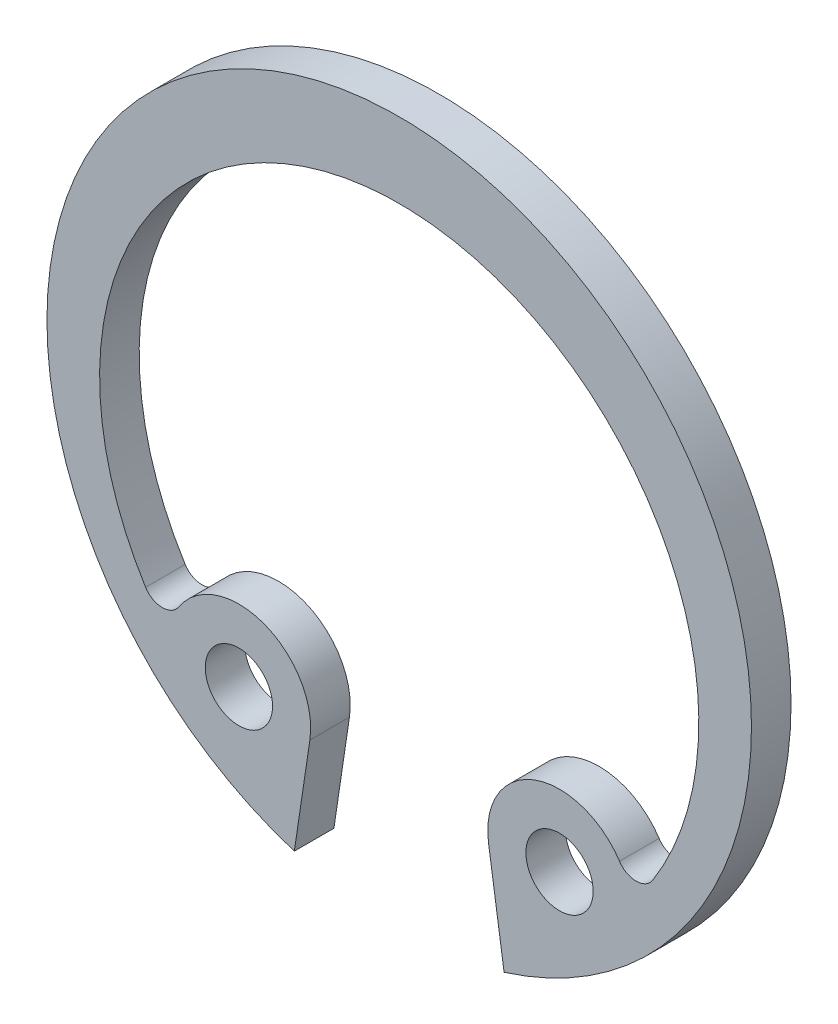
ISO-10303-21;
HEADER;
FILE_DESCRIPTION(('STEP AP214'),'2;1');
FILE_NAME('part.step','',(''),(''),'','','');
FILE_SCHEMA(('AUTOMOTIVE_DESIGN { 1 0 10303 214 1 1 1 1 }'));
ENDSEC;
DATA;
#1=APPLICATION_CONTEXT('core data for automotive mechanical design processes');
#2=APPLICATION_PROTOCOL_DEFINITION('international standard','automotive_design',2000,#1);
#3=PRODUCT_CONTEXT('',#1,'mechanical');
#4=PRODUCT('Part','Part','',(#3));
#5=PRODUCT_RELATED_PRODUCT_CATEGORY('part','',(#4));
#6=PRODUCT_DEFINITION_FORMATION('','',#4);
#7=PRODUCT_DEFINITION_CONTEXT('part definition',#1,'design');
#8=PRODUCT_DEFINITION('design','',#6,#7);
#9=PRODUCT_DEFINITION_SHAPE('','',#8);
#10=(LENGTH_UNIT() NAMED_UNIT(*) SI_UNIT(.MILLI.,.METRE.));
#11=(NAMED_UNIT(*) PLANE_ANGLE_UNIT() SI_UNIT($,.RADIAN.));
#12=(NAMED_UNIT(*) SI_UNIT($,.STERADIAN.) SOLID_ANGLE_UNIT());
#13=UNCERTAINTY_MEASURE_WITH_UNIT(LENGTH_MEASURE(1.E-05),#10,'distance_accuracy_value','');
#14=(GEOMETRIC_REPRESENTATION_CONTEXT(3) GLOBAL_UNCERTAINTY_ASSIGNED_CONTEXT((#13)) GLOBAL_UNIT_ASSIGNED_CONTEXT((#10,
#11,#12)) REPRESENTATION_CONTEXT('',''));
#15=CARTESIAN_POINT('',(0.,0.,0.));
#16=DIRECTION('',(0.,0.,1.));
#17=DIRECTION('',(1.,0.,0.));
#18=AXIS2_PLACEMENT_3D('',#15,#16,#17);
#19=CARTESIAN_POINT('',(-4.05,-5.60175763276171,1.));
#20=DIRECTION('',(0.,0.,1.));
#21=DIRECTION('',(1.,0.,0.));
#22=AXIS2_PLACEMENT_3D('',#19,#20,#21);
#23=PLANE('',#22);
#24=CARTESIAN_POINT('',(-4.05,-5.60175763276171,1.));
#25=DIRECTION('',(0.,0.,1.));
#26=DIRECTION('',(1.,0.,0.));
#27=AXIS2_PLACEMENT_3D('',#24,#25,#26);
#28=CIRCLE('',#27,0.85);
#29=CARTESIAN_POINT('',(-3.2,-5.60175763276171,1.));
#30=VERTEX_POINT('',#29);
#31=EDGE_CURVE('E161',#30,#30,#28,.T.);
#32=ORIENTED_EDGE('',*,*,#31,.F.);
#33=EDGE_LOOP('',(#32));
#34=FACE_BOUND('',#33,.T.);
#35=CARTESIAN_POINT('',(-4.05,-5.60175763276171,1.));
#36=DIRECTION('',(0.,0.,1.));
#37=DIRECTION('',(1.,0.,0.));
#38=AXIS2_PLACEMENT_3D('',#35,#36,#37);
#39=CIRCLE('',#38,1.81246617179456);
#40=CARTESIAN_POINT('',(-2.25744220428834,-5.869657190307,1.));
#41=VERTEX_POINT('',#40);
#42=CARTESIAN_POINT('',(-5.56612418959826,-4.60858037485926,1.));
#43=VERTEX_POINT('',#42);
#44=EDGE_CURVE('E179',#41,#43,#39,.T.);
#45=ORIENTED_EDGE('',*,*,#44,.T.);
#46=CARTESIAN_POINT('',(-5.98437315148016,-4.3345953280324,1.));
#47=DIRECTION('',(0.,0.,-1.));
#48=DIRECTION('',(1.,0.,0.));
#49=AXIS2_PLACEMENT_3D('',#46,#47,#48);
#50=CIRCLE('',#49,0.500000000000001);
#51=CARTESIAN_POINT('',(-6.40759614663435,-4.60083262138689,1.));
#52=VERTEX_POINT('',#51);
#53=EDGE_CURVE('E110',#43,#52,#50,.T.);
#54=ORIENTED_EDGE('',*,*,#53,.T.);
#55=CARTESIAN_POINT('',(0.,-0.57,1.));
#56=DIRECTION('',(0.,0.,-1.));
#57=DIRECTION('',(1.,0.,0.));
#58=AXIS2_PLACEMENT_3D('',#55,#56,#57);
#59=CIRCLE('',#58,7.57);
#60=CARTESIAN_POINT('',(6.40759614663435,-4.60083262138689,1.));
#61=VERTEX_POINT('',#60);
#62=EDGE_CURVE('E201',#52,#61,#59,.T.);
#63=ORIENTED_EDGE('',*,*,#62,.T.);
#64=CARTESIAN_POINT('',(5.98437315148016,-4.3345953280324,1.));
#65=DIRECTION('',(0.,0.,-1.));
#66=DIRECTION('',(-1.,0.,0.));
#67=AXIS2_PLACEMENT_3D('',#64,#65,#66);
#68=CIRCLE('',#67,0.500000000000001);
#69=CARTESIAN_POINT('',(5.56612418959826,-4.60858037485926,1.));
#70=VERTEX_POINT('',#69);
#71=EDGE_CURVE('E215',#61,#70,#68,.T.);
#72=ORIENTED_EDGE('',*,*,#71,.T.);
#73=CARTESIAN_POINT('',(4.05,-5.60175763276171,1.));
#74=DIRECTION('',(0.,0.,1.));
#75=DIRECTION('',(1.,0.,0.));
#76=AXIS2_PLACEMENT_3D('',#73,#74,#75);
#77=CIRCLE('',#76,1.81246617179456);
#78=CARTESIAN_POINT('',(2.25744220428834,-5.869657190307,1.));
#79=VERTEX_POINT('',#78);
#80=EDGE_CURVE('E133',#70,#79,#77,.T.);
#81=ORIENTED_EDGE('',*,*,#80,.T.);
#82=DIRECTION('',(0.147809411129611,-0.989015863361917,0.));
#83=VECTOR('',#82,1.);
#84=CARTESIAN_POINT('',(2.25744220428834,-5.869657190307,1.));
#85=LINE('',#84,#83);
#86=CARTESIAN_POINT('',(2.64999999999999,-8.49632273398322,1.));
#87=VERTEX_POINT('',#86);
#88=EDGE_CURVE('E127',#79,#87,#85,.T.);
#89=ORIENTED_EDGE('',*,*,#88,.T.);
#90=CARTESIAN_POINT('',(0.,0.,1.));
#91=DIRECTION('',(0.,0.,1.));
#92=DIRECTION('',(1.,0.,0.));
#93=AXIS2_PLACEMENT_3D('',#90,#91,#92);
#94=CIRCLE('',#93,8.9);
#95=CARTESIAN_POINT('',(-2.65,-8.49632273398321,1.));
#96=VERTEX_POINT('',#95);
#97=EDGE_CURVE('E131',#87,#96,#94,.T.);
#98=ORIENTED_EDGE('',*,*,#97,.T.);
#99=DIRECTION('',(0.147809411129611,0.989015863361917,0.));
#100=VECTOR('',#99,1.);
#101=CARTESIAN_POINT('',(-2.25744220428834,-5.869657190307,1.));
#102=LINE('',#101,#100);
#103=EDGE_CURVE('E58',#96,#41,#102,.T.);
#104=ORIENTED_EDGE('',*,*,#103,.T.);
#105=EDGE_LOOP('',(#45,#54,#63,#72,#81,#89,#98,#104));
#106=FACE_BOUND('',#105,.T.);
#107=CARTESIAN_POINT('',(4.05,-5.60175763276171,1.));
#108=DIRECTION('',(0.,0.,1.));
#109=DIRECTION('',(1.,0.,0.));
#110=AXIS2_PLACEMENT_3D('',#107,#108,#109);
#111=CIRCLE('',#110,0.85);
#112=CARTESIAN_POINT('',(4.9,-5.60175763276171,1.));
#113=VERTEX_POINT('',#112);
#114=EDGE_CURVE('E228',#113,#113,#111,.T.);
#115=ORIENTED_EDGE('',*,*,#114,.F.);
#116=EDGE_LOOP('',(#115));
#117=FACE_BOUND('',#116,.T.);
#118=ADVANCED_FACE('F37',(#34,#106,#117),#23,.T.);
#119=CARTESIAN_POINT('',(-4.05,-5.60175763276171,0.));
#120=DIRECTION('',(0.,0.,1.));
#121=DIRECTION('',(1.,0.,0.));
#122=AXIS2_PLACEMENT_3D('',#119,#120,#121);
#123=PLANE('',#122);
#124=CARTESIAN_POINT('',(-4.05,-5.60175763276171,0.));
#125=DIRECTION('',(0.,0.,1.));
#126=DIRECTION('',(1.,0.,0.));
#127=AXIS2_PLACEMENT_3D('',#124,#125,#126);
#128=CIRCLE('',#127,1.81246617179456);
#129=CARTESIAN_POINT('',(-2.25744220428834,-5.869657190307,0.));
#130=VERTEX_POINT('',#129);
#131=CARTESIAN_POINT('',(-5.56612418959826,-4.60858037485926,0.));
#132=VERTEX_POINT('',#131);
#133=EDGE_CURVE('E156',#130,#132,#128,.T.);
#134=ORIENTED_EDGE('',*,*,#133,.F.);
#135=DIRECTION('',(0.147809411129611,0.989015863361917,0.));
#136=VECTOR('',#135,1.);
#137=CARTESIAN_POINT('',(-2.25744220428834,-5.869657190307,0.));
#138=LINE('',#137,#136);
#139=CARTESIAN_POINT('',(-2.65,-8.49632273398321,0.));
#140=VERTEX_POINT('',#139);
#141=EDGE_CURVE('E101',#140,#130,#138,.T.);
#142=ORIENTED_EDGE('',*,*,#141,.F.);
#143=CARTESIAN_POINT('',(0.,0.,0.));
#144=DIRECTION('',(0.,0.,1.));
#145=DIRECTION('',(1.,0.,0.));
#146=AXIS2_PLACEMENT_3D('',#143,#144,#145);
#147=CIRCLE('',#146,8.9);
#148=CARTESIAN_POINT('',(2.64999999999999,-8.49632273398322,0.));
#149=VERTEX_POINT('',#148);
#150=EDGE_CURVE('E95',#149,#140,#147,.T.);
#151=ORIENTED_EDGE('',*,*,#150,.F.);
#152=DIRECTION('',(0.147809411129611,-0.989015863361917,0.));
#153=VECTOR('',#152,1.);
#154=CARTESIAN_POINT('',(2.25744220428834,-5.869657190307,0.));
#155=LINE('',#154,#153);
#156=CARTESIAN_POINT('',(2.25744220428834,-5.869657190307,0.));
#157=VERTEX_POINT('',#156);
#158=EDGE_CURVE('E142',#157,#149,#155,.T.);
#159=ORIENTED_EDGE('',*,*,#158,.F.);
#160=CARTESIAN_POINT('',(4.05,-5.60175763276171,0.));
#161=DIRECTION('',(0.,0.,1.));
#162=DIRECTION('',(1.,0.,0.));
#163=AXIS2_PLACEMENT_3D('',#160,#161,#162);
#164=CIRCLE('',#163,1.81246617179456);
#165=CARTESIAN_POINT('',(5.56612418959826,-4.60858037485926,0.));
#166=VERTEX_POINT('',#165);
#167=EDGE_CURVE('E170',#166,#157,#164,.T.);
#168=ORIENTED_EDGE('',*,*,#167,.F.);
#169=CARTESIAN_POINT('',(5.98437315148016,-4.3345953280324,0.));
#170=DIRECTION('',(0.,0.,-1.));
#171=DIRECTION('',(-1.,0.,0.));
#172=AXIS2_PLACEMENT_3D('',#169,#170,#171);
#173=CIRCLE('',#172,0.500000000000001);
#174=CARTESIAN_POINT('',(6.40759614663435,-4.60083262138689,0.));
#175=VERTEX_POINT('',#174);
#176=EDGE_CURVE('E167',#175,#166,#173,.T.);
#177=ORIENTED_EDGE('',*,*,#176,.F.);
#178=CARTESIAN_POINT('',(0.,-0.57,0.));
#179=DIRECTION('',(0.,0.,-1.));
#180=DIRECTION('',(1.,0.,0.));
#181=AXIS2_PLACEMENT_3D('',#178,#179,#180);
#182=CIRCLE('',#181,7.57);
#183=CARTESIAN_POINT('',(-6.40759614663435,-4.60083262138689,0.));
#184=VERTEX_POINT('',#183);
#185=EDGE_CURVE('E164',#184,#175,#182,.T.);
#186=ORIENTED_EDGE('',*,*,#185,.F.);
#187=CARTESIAN_POINT('',(-5.98437315148016,-4.3345953280324,0.));
#188=DIRECTION('',(0.,0.,-1.));
#189=DIRECTION('',(1.,0.,0.));
#190=AXIS2_PLACEMENT_3D('',#187,#188,#189);
#191=CIRCLE('',#190,0.500000000000001);
#192=EDGE_CURVE('E160',#132,#184,#191,.T.);
#193=ORIENTED_EDGE('',*,*,#192,.F.);
#194=EDGE_LOOP('',(#134,#142,#151,#159,#168,#177,#186,#193));
#195=FACE_BOUND('',#194,.T.);
#196=CARTESIAN_POINT('',(-4.05,-5.60175763276171,0.));
#197=DIRECTION('',(0.,0.,1.));
#198=DIRECTION('',(1.,0.,0.));
#199=AXIS2_PLACEMENT_3D('',#196,#197,#198);
#200=CIRCLE('',#199,0.85);
#201=CARTESIAN_POINT('',(-3.2,-5.60175763276171,0.));
#202=VERTEX_POINT('',#201);
#203=EDGE_CURVE('E224',#202,#202,#200,.T.);
#204=ORIENTED_EDGE('',*,*,#203,.T.);
#205=EDGE_LOOP('',(#204));
#206=FACE_BOUND('',#205,.T.);
#207=CARTESIAN_POINT('',(4.05,-5.60175763276171,0.));
#208=DIRECTION('',(0.,0.,1.));
#209=DIRECTION('',(1.,0.,0.));
#210=AXIS2_PLACEMENT_3D('',#207,#208,#209);
#211=CIRCLE('',#210,0.85);
#212=CARTESIAN_POINT('',(4.9,-5.60175763276171,0.));
#213=VERTEX_POINT('',#212);
#214=EDGE_CURVE('E232',#213,#213,#211,.T.);
#215=ORIENTED_EDGE('',*,*,#214,.T.);
#216=EDGE_LOOP('',(#215));
#217=FACE_BOUND('',#216,.T.);
#218=ADVANCED_FACE('F205',(#195,#206,#217),#123,.F.);
#219=CARTESIAN_POINT('',(-4.05,-5.60175763276171,1.));
#220=DIRECTION('',(0.,0.,-1.));
#221=DIRECTION('',(-1.,0.,0.));
#222=AXIS2_PLACEMENT_3D('',#219,#220,#221);
#223=CYLINDRICAL_SURFACE('',#222,1.81246617179456);
#224=ORIENTED_EDGE('',*,*,#133,.T.);
#225=DIRECTION('',(0.,0.,-1.));
#226=VECTOR('',#225,1.);
#227=CARTESIAN_POINT('',(-5.56612418959826,-4.60858037485926,1.));
#228=LINE('',#227,#226);
#229=EDGE_CURVE('E11',#43,#132,#228,.T.);
#230=ORIENTED_EDGE('',*,*,#229,.F.);
#231=ORIENTED_EDGE('',*,*,#44,.F.);
#232=DIRECTION('',(0.,0.,-1.));
#233=VECTOR('',#232,1.);
#234=CARTESIAN_POINT('',(-2.25744220428834,-5.869657190307,1.));
#235=LINE('',#234,#233);
#236=EDGE_CURVE('E152',#41,#130,#235,.T.);
#237=ORIENTED_EDGE('',*,*,#236,.T.);
#238=EDGE_LOOP('',(#224,#230,#231,#237));
#239=FACE_BOUND('',#238,.T.);
#240=ADVANCED_FACE('F39',(#239),#223,.T.);
#241=CARTESIAN_POINT('',(-5.98437315148016,-4.3345953280324,1.));
#242=DIRECTION('',(0.,0.,-1.));
#243=DIRECTION('',(-1.,0.,0.));
#244=AXIS2_PLACEMENT_3D('',#241,#242,#243);
#245=CYLINDRICAL_SURFACE('',#244,0.500000000000001);
#246=ORIENTED_EDGE('',*,*,#192,.T.);
#247=DIRECTION('',(0.,0.,-1.));
#248=VECTOR('',#247,1.);
#249=CARTESIAN_POINT('',(-6.40759614663435,-4.60083262138689,1.));
#250=LINE('',#249,#248);
#251=EDGE_CURVE('E47',#52,#184,#250,.T.);
#252=ORIENTED_EDGE('',*,*,#251,.F.);
#253=ORIENTED_EDGE('',*,*,#53,.F.);
#254=ORIENTED_EDGE('',*,*,#229,.T.);
#255=EDGE_LOOP('',(#246,#252,#253,#254));
#256=FACE_BOUND('',#255,.T.);
#257=ADVANCED_FACE('F265',(#256),#245,.F.);
#258=CARTESIAN_POINT('',(0.,-0.57,1.));
#259=DIRECTION('',(0.,0.,-1.));
#260=DIRECTION('',(-1.,0.,0.));
#261=AXIS2_PLACEMENT_3D('',#258,#259,#260);
#262=CYLINDRICAL_SURFACE('',#261,7.57);
#263=ORIENTED_EDGE('',*,*,#185,.T.);
#264=DIRECTION('',(0.,0.,-1.));
#265=VECTOR('',#264,1.);
#266=CARTESIAN_POINT('',(6.40759614663435,-4.60083262138689,1.));
#267=LINE('',#266,#265);
#268=EDGE_CURVE('E190',#61,#175,#267,.T.);
#269=ORIENTED_EDGE('',*,*,#268,.F.);
#270=ORIENTED_EDGE('',*,*,#62,.F.);
#271=ORIENTED_EDGE('',*,*,#251,.T.);
#272=EDGE_LOOP('',(#263,#269,#270,#271));
#273=FACE_BOUND('',#272,.T.);
#274=ADVANCED_FACE('F199',(#273),#262,.F.);
#275=CARTESIAN_POINT('',(5.98437315148016,-4.3345953280324,1.));
#276=DIRECTION('',(0.,0.,-1.));
#277=DIRECTION('',(-1.,0.,0.));
#278=AXIS2_PLACEMENT_3D('',#275,#276,#277);
#279=CYLINDRICAL_SURFACE('',#278,0.500000000000001);
#280=ORIENTED_EDGE('',*,*,#176,.T.);
#281=DIRECTION('',(0.,0.,-1.));
#282=VECTOR('',#281,1.);
#283=CARTESIAN_POINT('',(5.56612418959826,-4.60858037485926,1.));
#284=LINE('',#283,#282);
#285=EDGE_CURVE('E186',#70,#166,#284,.T.);
#286=ORIENTED_EDGE('',*,*,#285,.F.);
#287=ORIENTED_EDGE('',*,*,#71,.F.);
#288=ORIENTED_EDGE('',*,*,#268,.T.);
#289=EDGE_LOOP('',(#280,#286,#287,#288));
#290=FACE_BOUND('',#289,.T.);
#291=ADVANCED_FACE('F210',(#290),#279,.F.);
#292=CARTESIAN_POINT('',(4.05,-5.60175763276171,1.));
#293=DIRECTION('',(0.,0.,-1.));
#294=DIRECTION('',(-1.,0.,0.));
#295=AXIS2_PLACEMENT_3D('',#292,#293,#294);
#296=CYLINDRICAL_SURFACE('',#295,1.81246617179456);
#297=ORIENTED_EDGE('',*,*,#167,.T.);
#298=DIRECTION('',(0.,0.,-1.));
#299=VECTOR('',#298,1.);
#300=CARTESIAN_POINT('',(2.25744220428834,-5.869657190307,1.));
#301=LINE('',#300,#299);
#302=EDGE_CURVE('E144',#79,#157,#301,.T.);
#303=ORIENTED_EDGE('',*,*,#302,.F.);
#304=ORIENTED_EDGE('',*,*,#80,.F.);
#305=ORIENTED_EDGE('',*,*,#285,.T.);
#306=EDGE_LOOP('',(#297,#303,#304,#305));
#307=FACE_BOUND('',#306,.T.);
#308=ADVANCED_FACE('F213',(#307),#296,.T.);
#309=CARTESIAN_POINT('',(2.25744220428834,-5.869657190307,1.));
#310=DIRECTION('',(0.989015863361917,0.147809411129611,0.));
#311=DIRECTION('',(-0.147809411129611,0.989015863361917,0.));
#312=AXIS2_PLACEMENT_3D('',#309,#310,#311);
#313=PLANE('',#312);
#314=ORIENTED_EDGE('',*,*,#158,.T.);
#315=DIRECTION('',(0.,0.,-1.));
#316=VECTOR('',#315,1.);
#317=CARTESIAN_POINT('',(2.64999999999999,-8.49632273398322,1.));
#318=LINE('',#317,#316);
#319=EDGE_CURVE('E139',#87,#149,#318,.T.);
#320=ORIENTED_EDGE('',*,*,#319,.F.);
#321=ORIENTED_EDGE('',*,*,#88,.F.);
#322=ORIENTED_EDGE('',*,*,#302,.T.);
#323=EDGE_LOOP('',(#314,#320,#321,#322));
#324=FACE_BOUND('',#323,.T.);
#325=ADVANCED_FACE('F140',(#324),#313,.F.);
#326=CARTESIAN_POINT('',(0.,0.,1.));
#327=DIRECTION('',(0.,0.,-1.));
#328=DIRECTION('',(-1.,0.,0.));
#329=AXIS2_PLACEMENT_3D('',#326,#327,#328);
#330=CYLINDRICAL_SURFACE('',#329,8.9);
#331=ORIENTED_EDGE('',*,*,#150,.T.);
#332=DIRECTION('',(0.,0.,-1.));
#333=VECTOR('',#332,1.);
#334=CARTESIAN_POINT('',(-2.65,-8.49632273398321,1.));
#335=LINE('',#334,#333);
#336=EDGE_CURVE('E145',#96,#140,#335,.T.);
#337=ORIENTED_EDGE('',*,*,#336,.F.);
#338=ORIENTED_EDGE('',*,*,#97,.F.);
#339=ORIENTED_EDGE('',*,*,#319,.T.);
#340=EDGE_LOOP('',(#331,#337,#338,#339));
#341=FACE_BOUND('',#340,.T.);
#342=ADVANCED_FACE('F147',(#341),#330,.T.);
#343=CARTESIAN_POINT('',(-2.25744220428834,-5.869657190307,1.));
#344=DIRECTION('',(-0.989015863361917,0.147809411129611,0.));
#345=DIRECTION('',(-0.147809411129611,-0.989015863361917,0.));
#346=AXIS2_PLACEMENT_3D('',#343,#344,#345);
#347=PLANE('',#346);
#348=ORIENTED_EDGE('',*,*,#141,.T.);
#349=ORIENTED_EDGE('',*,*,#236,.F.);
#350=ORIENTED_EDGE('',*,*,#103,.F.);
#351=ORIENTED_EDGE('',*,*,#336,.T.);
#352=EDGE_LOOP('',(#348,#349,#350,#351));
#353=FACE_BOUND('',#352,.T.);
#354=ADVANCED_FACE('F253',(#353),#347,.F.);
#355=CARTESIAN_POINT('',(-4.05,-5.60175763276171,1.));
#356=DIRECTION('',(0.,0.,-1.));
#357=DIRECTION('',(-1.,0.,0.));
#358=AXIS2_PLACEMENT_3D('',#355,#356,#357);
#359=CYLINDRICAL_SURFACE('',#358,0.85);
#360=ORIENTED_EDGE('',*,*,#31,.T.);
#361=EDGE_LOOP('',(#360));
#362=FACE_BOUND('',#361,.T.);
#363=ORIENTED_EDGE('',*,*,#203,.F.);
#364=EDGE_LOOP('',(#363));
#365=FACE_BOUND('',#364,.T.);
#366=ADVANCED_FACE('F250',(#362,#365),#359,.F.);
#367=CARTESIAN_POINT('',(4.05,-5.60175763276171,1.));
#368=DIRECTION('',(0.,0.,-1.));
#369=DIRECTION('',(-1.,0.,0.));
#370=AXIS2_PLACEMENT_3D('',#367,#368,#369);
#371=CYLINDRICAL_SURFACE('',#370,0.85);
#372=ORIENTED_EDGE('',*,*,#114,.T.);
#373=EDGE_LOOP('',(#372));
#374=FACE_BOUND('',#373,.T.);
#375=ORIENTED_EDGE('',*,*,#214,.F.);
#376=EDGE_LOOP('',(#375));
#377=FACE_BOUND('',#376,.T.);
#378=ADVANCED_FACE('F239',(#374,#377),#371,.F.);
#379=CLOSED_SHELL('',(#118,#218,#240,#257,#274,#291,#308,#325,#342,#354,#366,#378));
#380=MANIFOLD_SOLID_BREP('B2',#379);
#381=ADVANCED_BREP_SHAPE_REPRESENTATION('',(#18,#380),#14);
#382=SHAPE_DEFINITION_REPRESENTATION(#9,#381);
ENDSEC;
END-ISO-10303-21;
